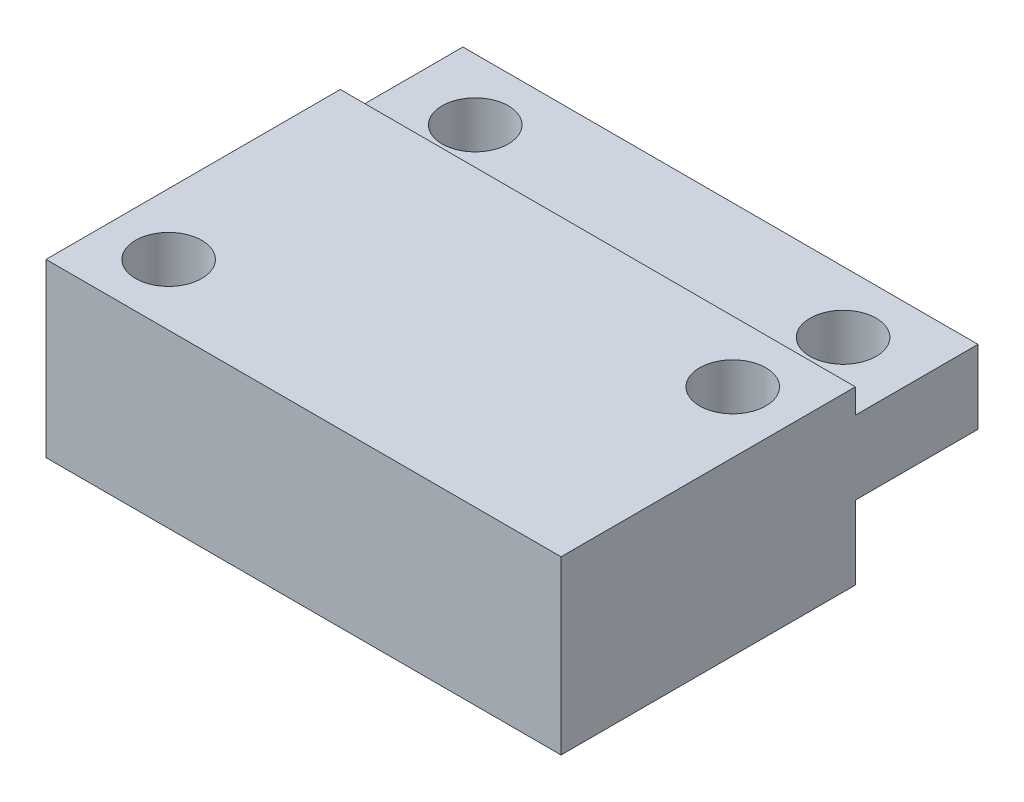
ISO-10303-21;
HEADER;
FILE_DESCRIPTION(('STEP AP214'),'2;1');
FILE_NAME('part.step','',(''),(''),'','','');
FILE_SCHEMA(('AUTOMOTIVE_DESIGN { 1 0 10303 214 1 1 1 1 }'));
ENDSEC;
DATA;
#1=APPLICATION_CONTEXT('core data for automotive mechanical design processes');
#2=APPLICATION_PROTOCOL_DEFINITION('international standard','automotive_design',2000,#1);
#3=PRODUCT_CONTEXT('',#1,'mechanical');
#4=PRODUCT('Part','Part','',(#3));
#5=PRODUCT_RELATED_PRODUCT_CATEGORY('part','',(#4));
#6=PRODUCT_DEFINITION_FORMATION('','',#4);
#7=PRODUCT_DEFINITION_CONTEXT('part definition',#1,'design');
#8=PRODUCT_DEFINITION('design','',#6,#7);
#9=PRODUCT_DEFINITION_SHAPE('','',#8);
#10=(LENGTH_UNIT() NAMED_UNIT(*) SI_UNIT(.MILLI.,.METRE.));
#11=(NAMED_UNIT(*) PLANE_ANGLE_UNIT() SI_UNIT($,.RADIAN.));
#12=(NAMED_UNIT(*) SI_UNIT($,.STERADIAN.) SOLID_ANGLE_UNIT());
#13=UNCERTAINTY_MEASURE_WITH_UNIT(LENGTH_MEASURE(1.E-05),#10,'distance_accuracy_value','');
#14=(GEOMETRIC_REPRESENTATION_CONTEXT(3) GLOBAL_UNCERTAINTY_ASSIGNED_CONTEXT((#13)) GLOBAL_UNIT_ASSIGNED_CONTEXT((#10,
#11,#12)) REPRESENTATION_CONTEXT('',''));
#15=CARTESIAN_POINT('',(0.,0.,0.));
#16=DIRECTION('',(0.,0.,1.));
#17=DIRECTION('',(1.,0.,0.));
#18=AXIS2_PLACEMENT_3D('',#15,#16,#17);
#19=CARTESIAN_POINT('',(-10.5,7.,-8.5));
#20=DIRECTION('',(0.,0.,1.));
#21=DIRECTION('',(1.,0.,0.));
#22=AXIS2_PLACEMENT_3D('',#19,#20,#21);
#23=PLANE('',#22);
#24=DIRECTION('',(1.,0.,0.));
#25=VECTOR('',#24,1.);
#26=CARTESIAN_POINT('',(0.,3.,-8.5));
#27=LINE('',#26,#25);
#28=CARTESIAN_POINT('',(-10.5,3.,-8.5));
#29=VERTEX_POINT('',#28);
#30=CARTESIAN_POINT('',(10.5,3.,-8.5));
#31=VERTEX_POINT('',#30);
#32=EDGE_CURVE('E109',#29,#31,#27,.T.);
#33=ORIENTED_EDGE('',*,*,#32,.F.);
#34=DIRECTION('',(0.,-1.,0.));
#35=VECTOR('',#34,1.);
#36=CARTESIAN_POINT('',(-10.5,7.,-8.5));
#37=LINE('',#36,#35);
#38=CARTESIAN_POINT('',(-10.5,6.,-8.5));
#39=VERTEX_POINT('',#38);
#40=EDGE_CURVE('E161',#39,#29,#37,.T.);
#41=ORIENTED_EDGE('',*,*,#40,.F.);
#42=DIRECTION('',(-1.,0.,0.));
#43=VECTOR('',#42,1.);
#44=CARTESIAN_POINT('',(-10.5,6.,-8.5));
#45=LINE('',#44,#43);
#46=CARTESIAN_POINT('',(10.5,6.,-8.5));
#47=VERTEX_POINT('',#46);
#48=EDGE_CURVE('E146',#47,#39,#45,.T.);
#49=ORIENTED_EDGE('',*,*,#48,.F.);
#50=DIRECTION('',(0.,-1.,0.));
#51=VECTOR('',#50,1.);
#52=CARTESIAN_POINT('',(10.5,7.,-8.5));
#53=LINE('',#52,#51);
#54=EDGE_CURVE('E168',#47,#31,#53,.T.);
#55=ORIENTED_EDGE('',*,*,#54,.T.);
#56=EDGE_LOOP('',(#33,#41,#49,#55));
#57=FACE_BOUND('',#56,.T.);
#58=ADVANCED_FACE('F33',(#57),#23,.F.);
#59=CARTESIAN_POINT('',(-10.5,7.,-8.5));
#60=DIRECTION('',(1.,0.,0.));
#61=DIRECTION('',(0.,0.,-1.));
#62=AXIS2_PLACEMENT_3D('',#59,#60,#61);
#63=PLANE('',#62);
#64=DIRECTION('',(0.,0.,-1.));
#65=VECTOR('',#64,1.);
#66=CARTESIAN_POINT('',(-10.5,3.,0.));
#67=LINE('',#66,#65);
#68=CARTESIAN_POINT('',(-10.5,3.,-3.5));
#69=VERTEX_POINT('',#68);
#70=EDGE_CURVE('E103',#69,#29,#67,.T.);
#71=ORIENTED_EDGE('',*,*,#70,.F.);
#72=DIRECTION('',(0.,-1.,0.));
#73=VECTOR('',#72,1.);
#74=CARTESIAN_POINT('',(-10.5,3.,-3.5));
#75=LINE('',#74,#73);
#76=CARTESIAN_POINT('',(-10.5,0.,-3.5));
#77=VERTEX_POINT('',#76);
#78=EDGE_CURVE('E100',#69,#77,#75,.T.);
#79=ORIENTED_EDGE('',*,*,#78,.T.);
#80=DIRECTION('',(0.,0.,1.));
#81=VECTOR('',#80,1.);
#82=CARTESIAN_POINT('',(-10.5,0.,-8.5));
#83=LINE('',#82,#81);
#84=CARTESIAN_POINT('',(-10.5,0.,8.5));
#85=VERTEX_POINT('',#84);
#86=EDGE_CURVE('E152',#77,#85,#83,.T.);
#87=ORIENTED_EDGE('',*,*,#86,.T.);
#88=DIRECTION('',(0.,-1.,0.));
#89=VECTOR('',#88,1.);
#90=CARTESIAN_POINT('',(-10.5,7.,8.5));
#91=LINE('',#90,#89);
#92=CARTESIAN_POINT('',(-10.5,7.,8.5));
#93=VERTEX_POINT('',#92);
#94=EDGE_CURVE('E11',#93,#85,#91,.T.);
#95=ORIENTED_EDGE('',*,*,#94,.F.);
#96=DIRECTION('',(0.,0.,1.));
#97=VECTOR('',#96,1.);
#98=CARTESIAN_POINT('',(-10.5,7.,-8.5));
#99=LINE('',#98,#97);
#100=CARTESIAN_POINT('',(-10.5,7.,-3.5));
#101=VERTEX_POINT('',#100);
#102=EDGE_CURVE('E154',#101,#93,#99,.T.);
#103=ORIENTED_EDGE('',*,*,#102,.F.);
#104=DIRECTION('',(0.,1.,0.));
#105=VECTOR('',#104,1.);
#106=CARTESIAN_POINT('',(-10.5,6.,-3.5));
#107=LINE('',#106,#105);
#108=CARTESIAN_POINT('',(-10.5,6.,-3.5));
#109=VERTEX_POINT('',#108);
#110=EDGE_CURVE('E56',#109,#101,#107,.T.);
#111=ORIENTED_EDGE('',*,*,#110,.F.);
#112=DIRECTION('',(0.,0.,1.));
#113=VECTOR('',#112,1.);
#114=CARTESIAN_POINT('',(-10.5,6.,-8.5));
#115=LINE('',#114,#113);
#116=EDGE_CURVE('E138',#39,#109,#115,.T.);
#117=ORIENTED_EDGE('',*,*,#116,.F.);
#118=ORIENTED_EDGE('',*,*,#40,.T.);
#119=EDGE_LOOP('',(#71,#79,#87,#95,#103,#111,#117,#118));
#120=FACE_BOUND('',#119,.T.);
#121=ADVANCED_FACE('F35',(#120),#63,.F.);
#122=CARTESIAN_POINT('',(-10.5,7.,8.5));
#123=DIRECTION('',(0.,0.,-1.));
#124=DIRECTION('',(-1.,0.,0.));
#125=AXIS2_PLACEMENT_3D('',#122,#123,#124);
#126=PLANE('',#125);
#127=DIRECTION('',(1.,0.,0.));
#128=VECTOR('',#127,1.);
#129=CARTESIAN_POINT('',(-10.5,0.,8.5));
#130=LINE('',#129,#128);
#131=CARTESIAN_POINT('',(10.5,0.,8.5));
#132=VERTEX_POINT('',#131);
#133=EDGE_CURVE('E163',#85,#132,#130,.T.);
#134=ORIENTED_EDGE('',*,*,#133,.T.);
#135=DIRECTION('',(0.,-1.,0.));
#136=VECTOR('',#135,1.);
#137=CARTESIAN_POINT('',(10.5,7.,8.5));
#138=LINE('',#137,#136);
#139=CARTESIAN_POINT('',(10.5,7.,8.5));
#140=VERTEX_POINT('',#139);
#141=EDGE_CURVE('E41',#140,#132,#138,.T.);
#142=ORIENTED_EDGE('',*,*,#141,.F.);
#143=DIRECTION('',(1.,0.,0.));
#144=VECTOR('',#143,1.);
#145=CARTESIAN_POINT('',(-10.5,7.,8.5));
#146=LINE('',#145,#144);
#147=EDGE_CURVE('E156',#93,#140,#146,.T.);
#148=ORIENTED_EDGE('',*,*,#147,.F.);
#149=ORIENTED_EDGE('',*,*,#94,.T.);
#150=EDGE_LOOP('',(#134,#142,#148,#149));
#151=FACE_BOUND('',#150,.T.);
#152=ADVANCED_FACE('F214',(#151),#126,.F.);
#153=CARTESIAN_POINT('',(10.5,7.,-8.5));
#154=DIRECTION('',(-1.,0.,0.));
#155=DIRECTION('',(0.,0.,1.));
#156=AXIS2_PLACEMENT_3D('',#153,#154,#155);
#157=PLANE('',#156);
#158=DIRECTION('',(0.,0.,-1.));
#159=VECTOR('',#158,1.);
#160=CARTESIAN_POINT('',(10.5,0.,-8.5));
#161=LINE('',#160,#159);
#162=CARTESIAN_POINT('',(10.5,0.,-3.5));
#163=VERTEX_POINT('',#162);
#164=EDGE_CURVE('E119',#132,#163,#161,.T.);
#165=ORIENTED_EDGE('',*,*,#164,.T.);
#166=DIRECTION('',(0.,-1.,0.));
#167=VECTOR('',#166,1.);
#168=CARTESIAN_POINT('',(10.5,3.,-3.5));
#169=LINE('',#168,#167);
#170=CARTESIAN_POINT('',(10.5,3.,-3.5));
#171=VERTEX_POINT('',#170);
#172=EDGE_CURVE('E48',#171,#163,#169,.T.);
#173=ORIENTED_EDGE('',*,*,#172,.F.);
#174=DIRECTION('',(0.,0.,1.));
#175=VECTOR('',#174,1.);
#176=CARTESIAN_POINT('',(10.5,3.,0.));
#177=LINE('',#176,#175);
#178=EDGE_CURVE('E104',#31,#171,#177,.T.);
#179=ORIENTED_EDGE('',*,*,#178,.F.);
#180=ORIENTED_EDGE('',*,*,#54,.F.);
#181=DIRECTION('',(0.,0.,-1.));
#182=VECTOR('',#181,1.);
#183=CARTESIAN_POINT('',(10.5,6.,-8.5));
#184=LINE('',#183,#182);
#185=CARTESIAN_POINT('',(10.5,6.,-3.5));
#186=VERTEX_POINT('',#185);
#187=EDGE_CURVE('E144',#186,#47,#184,.T.);
#188=ORIENTED_EDGE('',*,*,#187,.F.);
#189=DIRECTION('',(0.,1.,0.));
#190=VECTOR('',#189,1.);
#191=CARTESIAN_POINT('',(10.5,6.,-3.5));
#192=LINE('',#191,#190);
#193=CARTESIAN_POINT('',(10.5,7.,-3.5));
#194=VERTEX_POINT('',#193);
#195=EDGE_CURVE('E149',#186,#194,#192,.T.);
#196=ORIENTED_EDGE('',*,*,#195,.T.);
#197=DIRECTION('',(0.,0.,-1.));
#198=VECTOR('',#197,1.);
#199=CARTESIAN_POINT('',(10.5,7.,-8.5));
#200=LINE('',#199,#198);
#201=EDGE_CURVE('E158',#140,#194,#200,.T.);
#202=ORIENTED_EDGE('',*,*,#201,.F.);
#203=ORIENTED_EDGE('',*,*,#141,.T.);
#204=EDGE_LOOP('',(#165,#173,#179,#180,#188,#196,#202,#203));
#205=FACE_BOUND('',#204,.T.);
#206=ADVANCED_FACE('F116',(#205),#157,.F.);
#207=CARTESIAN_POINT('',(0.,7.,0.));
#208=DIRECTION('',(0.,1.,0.));
#209=DIRECTION('',(0.,0.,1.));
#210=AXIS2_PLACEMENT_3D('',#207,#208,#209);
#211=PLANE('',#210);
#212=CARTESIAN_POINT('',(-8.,7.,6.));
#213=DIRECTION('',(0.,1.,0.));
#214=DIRECTION('',(0.,0.,1.));
#215=AXIS2_PLACEMENT_3D('',#212,#213,#214);
#216=CIRCLE('',#215,1.34999999999999);
#217=CARTESIAN_POINT('',(-8.,7.,7.34999999999999));
#218=VERTEX_POINT('',#217);
#219=EDGE_CURVE('E121',#218,#218,#216,.T.);
#220=ORIENTED_EDGE('',*,*,#219,.F.);
#221=EDGE_LOOP('',(#220));
#222=FACE_BOUND('',#221,.T.);
#223=CARTESIAN_POINT('',(8.,7.,-1.));
#224=DIRECTION('',(0.,1.,0.));
#225=DIRECTION('',(0.,0.,1.));
#226=AXIS2_PLACEMENT_3D('',#223,#224,#225);
#227=CIRCLE('',#226,1.34999999999999);
#228=CARTESIAN_POINT('',(8.,7.,0.349999999999988));
#229=VERTEX_POINT('',#228);
#230=EDGE_CURVE('E131',#229,#229,#227,.T.);
#231=ORIENTED_EDGE('',*,*,#230,.F.);
#232=EDGE_LOOP('',(#231));
#233=FACE_BOUND('',#232,.T.);
#234=DIRECTION('',(1.,0.,0.));
#235=VECTOR('',#234,1.);
#236=CARTESIAN_POINT('',(-10.5,7.,-3.5));
#237=LINE('',#236,#235);
#238=EDGE_CURVE('E137',#101,#194,#237,.T.);
#239=ORIENTED_EDGE('',*,*,#238,.F.);
#240=ORIENTED_EDGE('',*,*,#102,.T.);
#241=ORIENTED_EDGE('',*,*,#147,.T.);
#242=ORIENTED_EDGE('',*,*,#201,.T.);
#243=EDGE_LOOP('',(#239,#240,#241,#242));
#244=FACE_BOUND('',#243,.T.);
#245=ADVANCED_FACE('F220',(#222,#233,#244),#211,.T.);
#246=CARTESIAN_POINT('',(0.,0.,0.));
#247=DIRECTION('',(0.,1.,0.));
#248=DIRECTION('',(0.,0.,1.));
#249=AXIS2_PLACEMENT_3D('',#246,#247,#248);
#250=PLANE('',#249);
#251=CARTESIAN_POINT('',(-8.,0.,6.));
#252=DIRECTION('',(0.,1.,0.));
#253=DIRECTION('',(0.,0.,1.));
#254=AXIS2_PLACEMENT_3D('',#251,#252,#253);
#255=CIRCLE('',#254,1.35);
#256=CARTESIAN_POINT('',(-8.,0.,7.35));
#257=VERTEX_POINT('',#256);
#258=EDGE_CURVE('E128',#257,#257,#255,.T.);
#259=ORIENTED_EDGE('',*,*,#258,.T.);
#260=EDGE_LOOP('',(#259));
#261=FACE_BOUND('',#260,.T.);
#262=CARTESIAN_POINT('',(8.,0.,-1.));
#263=DIRECTION('',(0.,1.,0.));
#264=DIRECTION('',(0.,0.,1.));
#265=AXIS2_PLACEMENT_3D('',#262,#263,#264);
#266=CIRCLE('',#265,1.35);
#267=CARTESIAN_POINT('',(8.,0.,0.349999999999999));
#268=VERTEX_POINT('',#267);
#269=EDGE_CURVE('E134',#268,#268,#266,.T.);
#270=ORIENTED_EDGE('',*,*,#269,.T.);
#271=EDGE_LOOP('',(#270));
#272=FACE_BOUND('',#271,.T.);
#273=ORIENTED_EDGE('',*,*,#86,.F.);
#274=DIRECTION('',(-1.,0.,0.));
#275=VECTOR('',#274,1.);
#276=CARTESIAN_POINT('',(0.,0.,-3.5));
#277=LINE('',#276,#275);
#278=EDGE_CURVE('E113',#163,#77,#277,.T.);
#279=ORIENTED_EDGE('',*,*,#278,.F.);
#280=ORIENTED_EDGE('',*,*,#164,.F.);
#281=ORIENTED_EDGE('',*,*,#133,.F.);
#282=EDGE_LOOP('',(#273,#279,#280,#281));
#283=FACE_BOUND('',#282,.T.);
#284=ADVANCED_FACE('F176',(#261,#272,#283),#250,.F.);
#285=CARTESIAN_POINT('',(-10.5,6.,-3.5));
#286=DIRECTION('',(0.,0.,1.));
#287=DIRECTION('',(1.,0.,0.));
#288=AXIS2_PLACEMENT_3D('',#285,#286,#287);
#289=PLANE('',#288);
#290=ORIENTED_EDGE('',*,*,#238,.T.);
#291=ORIENTED_EDGE('',*,*,#195,.F.);
#292=DIRECTION('',(1.,0.,0.));
#293=VECTOR('',#292,1.);
#294=CARTESIAN_POINT('',(-10.5,6.,-3.5));
#295=LINE('',#294,#293);
#296=EDGE_CURVE('E141',#109,#186,#295,.T.);
#297=ORIENTED_EDGE('',*,*,#296,.F.);
#298=ORIENTED_EDGE('',*,*,#110,.T.);
#299=EDGE_LOOP('',(#290,#291,#297,#298));
#300=FACE_BOUND('',#299,.T.);
#301=ADVANCED_FACE('F232',(#300),#289,.F.);
#302=CARTESIAN_POINT('',(0.,6.,0.));
#303=DIRECTION('',(0.,1.,0.));
#304=DIRECTION('',(0.,0.,1.));
#305=AXIS2_PLACEMENT_3D('',#302,#303,#304);
#306=PLANE('',#305);
#307=CARTESIAN_POINT('',(7.5,6.,-6.));
#308=DIRECTION('',(0.,1.,0.));
#309=DIRECTION('',(0.,0.,1.));
#310=AXIS2_PLACEMENT_3D('',#307,#308,#309);
#311=CIRCLE('',#310,1.35);
#312=CARTESIAN_POINT('',(7.5,6.,-4.65));
#313=VERTEX_POINT('',#312);
#314=EDGE_CURVE('E185',#313,#313,#311,.T.);
#315=ORIENTED_EDGE('',*,*,#314,.F.);
#316=EDGE_LOOP('',(#315));
#317=FACE_BOUND('',#316,.T.);
#318=CARTESIAN_POINT('',(-7.5,6.,-6.));
#319=DIRECTION('',(0.,1.,0.));
#320=DIRECTION('',(0.,0.,1.));
#321=AXIS2_PLACEMENT_3D('',#318,#319,#320);
#322=CIRCLE('',#321,1.35);
#323=CARTESIAN_POINT('',(-7.5,6.,-4.65));
#324=VERTEX_POINT('',#323);
#325=EDGE_CURVE('E177',#324,#324,#322,.T.);
#326=ORIENTED_EDGE('',*,*,#325,.F.);
#327=EDGE_LOOP('',(#326));
#328=FACE_BOUND('',#327,.T.);
#329=ORIENTED_EDGE('',*,*,#116,.T.);
#330=ORIENTED_EDGE('',*,*,#296,.T.);
#331=ORIENTED_EDGE('',*,*,#187,.T.);
#332=ORIENTED_EDGE('',*,*,#48,.T.);
#333=EDGE_LOOP('',(#329,#330,#331,#332));
#334=FACE_BOUND('',#333,.T.);
#335=ADVANCED_FACE('F231',(#317,#328,#334),#306,.T.);
#336=CARTESIAN_POINT('',(8.,7.,-1.));
#337=DIRECTION('',(0.,1.,0.));
#338=DIRECTION('',(0.,0.,1.));
#339=AXIS2_PLACEMENT_3D('',#336,#337,#338);
#340=CYLINDRICAL_SURFACE('',#339,1.34999999999999);
#341=ORIENTED_EDGE('',*,*,#269,.F.);
#342=EDGE_LOOP('',(#341));
#343=FACE_BOUND('',#342,.T.);
#344=ORIENTED_EDGE('',*,*,#230,.T.);
#345=EDGE_LOOP('',(#344));
#346=FACE_BOUND('',#345,.T.);
#347=ADVANCED_FACE('F247',(#343,#346),#340,.F.);
#348=CARTESIAN_POINT('',(-8.,7.,6.));
#349=DIRECTION('',(0.,1.,0.));
#350=DIRECTION('',(0.,0.,1.));
#351=AXIS2_PLACEMENT_3D('',#348,#349,#350);
#352=CYLINDRICAL_SURFACE('',#351,1.34999999999999);
#353=ORIENTED_EDGE('',*,*,#258,.F.);
#354=EDGE_LOOP('',(#353));
#355=FACE_BOUND('',#354,.T.);
#356=ORIENTED_EDGE('',*,*,#219,.T.);
#357=EDGE_LOOP('',(#356));
#358=FACE_BOUND('',#357,.T.);
#359=ADVANCED_FACE('F251',(#355,#358),#352,.F.);
#360=CARTESIAN_POINT('',(0.,3.,-3.5));
#361=DIRECTION('',(0.,0.,1.));
#362=DIRECTION('',(1.,0.,0.));
#363=AXIS2_PLACEMENT_3D('',#360,#361,#362);
#364=PLANE('',#363);
#365=ORIENTED_EDGE('',*,*,#278,.T.);
#366=ORIENTED_EDGE('',*,*,#78,.F.);
#367=DIRECTION('',(-1.,0.,0.));
#368=VECTOR('',#367,1.);
#369=CARTESIAN_POINT('',(0.,3.,-3.5));
#370=LINE('',#369,#368);
#371=EDGE_CURVE('E96',#171,#69,#370,.T.);
#372=ORIENTED_EDGE('',*,*,#371,.F.);
#373=ORIENTED_EDGE('',*,*,#172,.T.);
#374=EDGE_LOOP('',(#365,#366,#372,#373));
#375=FACE_BOUND('',#374,.T.);
#376=ADVANCED_FACE('F98',(#375),#364,.F.);
#377=CARTESIAN_POINT('',(0.,3.,0.));
#378=DIRECTION('',(0.,-1.,0.));
#379=DIRECTION('',(0.,0.,-1.));
#380=AXIS2_PLACEMENT_3D('',#377,#378,#379);
#381=PLANE('',#380);
#382=CARTESIAN_POINT('',(7.5,3.,-6.));
#383=DIRECTION('',(0.,-1.,0.));
#384=DIRECTION('',(0.,0.,-1.));
#385=AXIS2_PLACEMENT_3D('',#382,#383,#384);
#386=CIRCLE('',#385,1.35);
#387=CARTESIAN_POINT('',(7.5,3.,-7.35));
#388=VERTEX_POINT('',#387);
#389=EDGE_CURVE('E188',#388,#388,#386,.T.);
#390=ORIENTED_EDGE('',*,*,#389,.F.);
#391=EDGE_LOOP('',(#390));
#392=FACE_BOUND('',#391,.T.);
#393=CARTESIAN_POINT('',(-7.5,3.,-6.));
#394=DIRECTION('',(0.,-1.,0.));
#395=DIRECTION('',(0.,0.,-1.));
#396=AXIS2_PLACEMENT_3D('',#393,#394,#395);
#397=CIRCLE('',#396,1.35);
#398=CARTESIAN_POINT('',(-7.5,3.,-7.35));
#399=VERTEX_POINT('',#398);
#400=EDGE_CURVE('E179',#399,#399,#397,.T.);
#401=ORIENTED_EDGE('',*,*,#400,.F.);
#402=EDGE_LOOP('',(#401));
#403=FACE_BOUND('',#402,.T.);
#404=ORIENTED_EDGE('',*,*,#178,.T.);
#405=ORIENTED_EDGE('',*,*,#371,.T.);
#406=ORIENTED_EDGE('',*,*,#70,.T.);
#407=ORIENTED_EDGE('',*,*,#32,.T.);
#408=EDGE_LOOP('',(#404,#405,#406,#407));
#409=FACE_BOUND('',#408,.T.);
#410=ADVANCED_FACE('F107',(#392,#403,#409),#381,.T.);
#411=CARTESIAN_POINT('',(-7.5,3.,-6.));
#412=DIRECTION('',(0.,-1.,0.));
#413=DIRECTION('',(0.,0.,-1.));
#414=AXIS2_PLACEMENT_3D('',#411,#412,#413);
#415=CYLINDRICAL_SURFACE('',#414,1.35);
#416=ORIENTED_EDGE('',*,*,#325,.T.);
#417=EDGE_LOOP('',(#416));
#418=FACE_BOUND('',#417,.T.);
#419=ORIENTED_EDGE('',*,*,#400,.T.);
#420=EDGE_LOOP('',(#419));
#421=FACE_BOUND('',#420,.T.);
#422=ADVANCED_FACE('F196',(#418,#421),#415,.F.);
#423=CARTESIAN_POINT('',(7.5,3.,-6.));
#424=DIRECTION('',(0.,-1.,0.));
#425=DIRECTION('',(0.,0.,-1.));
#426=AXIS2_PLACEMENT_3D('',#423,#424,#425);
#427=CYLINDRICAL_SURFACE('',#426,1.35);
#428=ORIENTED_EDGE('',*,*,#314,.T.);
#429=EDGE_LOOP('',(#428));
#430=FACE_BOUND('',#429,.T.);
#431=ORIENTED_EDGE('',*,*,#389,.T.);
#432=EDGE_LOOP('',(#431));
#433=FACE_BOUND('',#432,.T.);
#434=ADVANCED_FACE('F192',(#430,#433),#427,.F.);
#435=CLOSED_SHELL('',(#58,#121,#152,#206,#245,#284,#301,#335,#347,#359,#376,#410,#422,#434));
#436=MANIFOLD_SOLID_BREP('B2',#435);
#437=ADVANCED_BREP_SHAPE_REPRESENTATION('',(#18,#436),#14);
#438=SHAPE_DEFINITION_REPRESENTATION(#9,#437);
ENDSEC;
END-ISO-10303-21;
